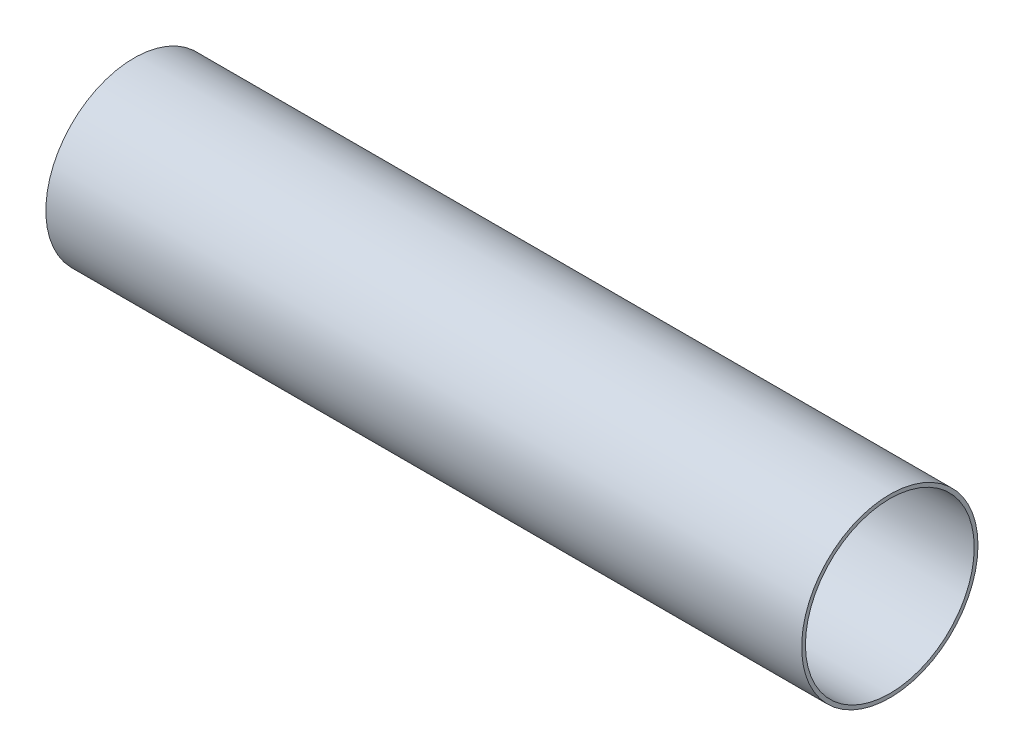
ISO-10303-21;
HEADER;
FILE_DESCRIPTION(('STEP AP214'),'2;1');
FILE_NAME('part.step','',(''),(''),'','','');
FILE_SCHEMA(('AUTOMOTIVE_DESIGN { 1 0 10303 214 1 1 1 1 }'));
ENDSEC;
DATA;
#1=APPLICATION_CONTEXT('core data for automotive mechanical design processes');
#2=APPLICATION_PROTOCOL_DEFINITION('international standard','automotive_design',2000,#1);
#3=PRODUCT_CONTEXT('',#1,'mechanical');
#4=PRODUCT('Part','Part','',(#3));
#5=PRODUCT_RELATED_PRODUCT_CATEGORY('part','',(#4));
#6=PRODUCT_DEFINITION_FORMATION('','',#4);
#7=PRODUCT_DEFINITION_CONTEXT('part definition',#1,'design');
#8=PRODUCT_DEFINITION('design','',#6,#7);
#9=PRODUCT_DEFINITION_SHAPE('','',#8);
#10=(LENGTH_UNIT() NAMED_UNIT(*) SI_UNIT(.MILLI.,.METRE.));
#11=(NAMED_UNIT(*) PLANE_ANGLE_UNIT() SI_UNIT($,.RADIAN.));
#12=(NAMED_UNIT(*) SI_UNIT($,.STERADIAN.) SOLID_ANGLE_UNIT());
#13=UNCERTAINTY_MEASURE_WITH_UNIT(LENGTH_MEASURE(1.E-05),#10,'distance_accuracy_value','');
#14=(GEOMETRIC_REPRESENTATION_CONTEXT(3) GLOBAL_UNCERTAINTY_ASSIGNED_CONTEXT((#13)) GLOBAL_UNIT_ASSIGNED_CONTEXT((#10,
#11,#12)) REPRESENTATION_CONTEXT('',''));
#15=CARTESIAN_POINT('',(0.,0.,0.));
#16=DIRECTION('',(0.,0.,1.));
#17=DIRECTION('',(1.,0.,0.));
#18=AXIS2_PLACEMENT_3D('',#15,#16,#17);
#19=CARTESIAN_POINT('',(300.,0.,0.));
#20=DIRECTION('',(1.,0.,0.));
#21=DIRECTION('',(0.,0.,-1.));
#22=AXIS2_PLACEMENT_3D('',#19,#20,#21);
#23=PLANE('',#22);
#24=CARTESIAN_POINT('',(300.,0.,0.));
#25=DIRECTION('',(1.,0.,0.));
#26=DIRECTION('',(0.,0.,-1.));
#27=AXIS2_PLACEMENT_3D('',#24,#25,#26);
#28=CIRCLE('',#27,35.);
#29=CARTESIAN_POINT('',(300.,0.,-35.));
#30=VERTEX_POINT('',#29);
#31=EDGE_CURVE('E10',#30,#30,#28,.T.);
#32=ORIENTED_EDGE('',*,*,#31,.T.);
#33=EDGE_LOOP('',(#32));
#34=FACE_BOUND('',#33,.T.);
#35=CARTESIAN_POINT('',(300.,0.,0.));
#36=DIRECTION('',(1.,0.,0.));
#37=DIRECTION('',(0.,0.,-1.));
#38=AXIS2_PLACEMENT_3D('',#35,#36,#37);
#39=CIRCLE('',#38,33.5);
#40=CARTESIAN_POINT('',(300.,0.,-33.5));
#41=VERTEX_POINT('',#40);
#42=EDGE_CURVE('E52',#41,#41,#39,.T.);
#43=ORIENTED_EDGE('',*,*,#42,.F.);
#44=EDGE_LOOP('',(#43));
#45=FACE_BOUND('',#44,.T.);
#46=ADVANCED_FACE('F41',(#34,#45),#23,.T.);
#47=CARTESIAN_POINT('',(0.,0.,0.));
#48=DIRECTION('',(1.,0.,0.));
#49=DIRECTION('',(0.,0.,-1.));
#50=AXIS2_PLACEMENT_3D('',#47,#48,#49);
#51=PLANE('',#50);
#52=CARTESIAN_POINT('',(0.,0.,0.));
#53=DIRECTION('',(1.,0.,0.));
#54=DIRECTION('',(0.,0.,-1.));
#55=AXIS2_PLACEMENT_3D('',#52,#53,#54);
#56=CIRCLE('',#55,35.);
#57=CARTESIAN_POINT('',(0.,0.,-35.));
#58=VERTEX_POINT('',#57);
#59=EDGE_CURVE('E45',#58,#58,#56,.T.);
#60=ORIENTED_EDGE('',*,*,#59,.F.);
#61=EDGE_LOOP('',(#60));
#62=FACE_BOUND('',#61,.T.);
#63=CARTESIAN_POINT('',(0.,0.,0.));
#64=DIRECTION('',(1.,0.,0.));
#65=DIRECTION('',(0.,0.,-1.));
#66=AXIS2_PLACEMENT_3D('',#63,#64,#65);
#67=CIRCLE('',#66,33.5);
#68=CARTESIAN_POINT('',(0.,0.,-33.5));
#69=VERTEX_POINT('',#68);
#70=EDGE_CURVE('E54',#69,#69,#67,.T.);
#71=ORIENTED_EDGE('',*,*,#70,.T.);
#72=EDGE_LOOP('',(#71));
#73=FACE_BOUND('',#72,.T.);
#74=ADVANCED_FACE('F64',(#62,#73),#51,.F.);
#75=CARTESIAN_POINT('',(300.,0.,0.));
#76=DIRECTION('',(-1.,0.,0.));
#77=DIRECTION('',(0.,0.,1.));
#78=AXIS2_PLACEMENT_3D('',#75,#76,#77);
#79=CYLINDRICAL_SURFACE('',#78,35.);
#80=ORIENTED_EDGE('',*,*,#31,.F.);
#81=EDGE_LOOP('',(#80));
#82=FACE_BOUND('',#81,.T.);
#83=ORIENTED_EDGE('',*,*,#59,.T.);
#84=EDGE_LOOP('',(#83));
#85=FACE_BOUND('',#84,.T.);
#86=ADVANCED_FACE('F43',(#82,#85),#79,.T.);
#87=CARTESIAN_POINT('',(300.,0.,0.));
#88=DIRECTION('',(-1.,0.,0.));
#89=DIRECTION('',(0.,0.,1.));
#90=AXIS2_PLACEMENT_3D('',#87,#88,#89);
#91=CYLINDRICAL_SURFACE('',#90,33.5);
#92=ORIENTED_EDGE('',*,*,#42,.T.);
#93=EDGE_LOOP('',(#92));
#94=FACE_BOUND('',#93,.T.);
#95=ORIENTED_EDGE('',*,*,#70,.F.);
#96=EDGE_LOOP('',(#95));
#97=FACE_BOUND('',#96,.T.);
#98=ADVANCED_FACE('F60',(#94,#97),#91,.F.);
#99=CLOSED_SHELL('',(#46,#74,#86,#98));
#100=MANIFOLD_SOLID_BREP('B2',#99);
#101=ADVANCED_BREP_SHAPE_REPRESENTATION('',(#18,#100),#14);
#102=SHAPE_DEFINITION_REPRESENTATION(#9,#101);
ENDSEC;
END-ISO-10303-21;
